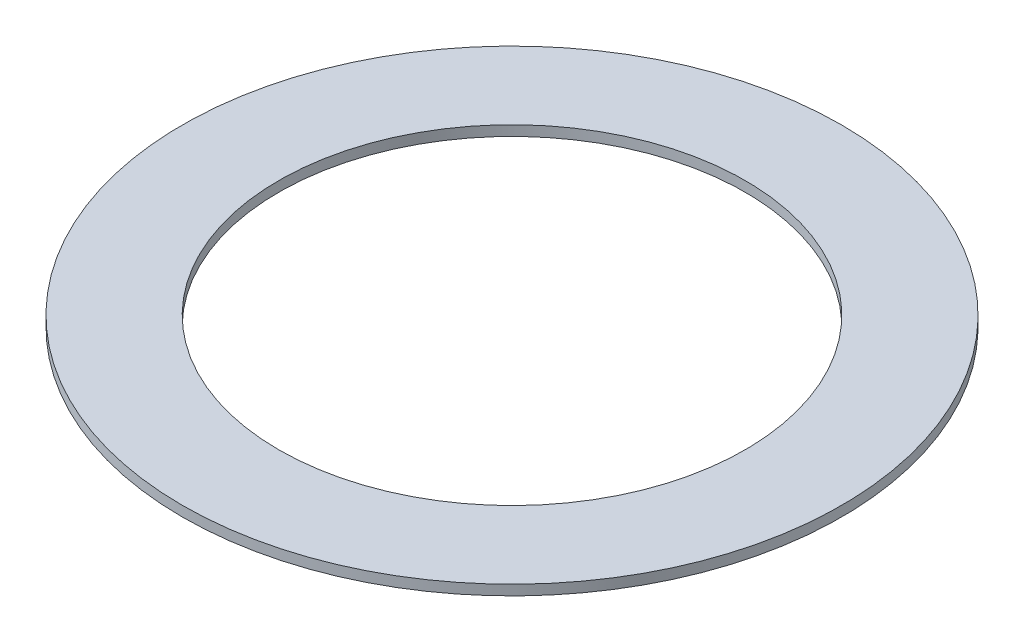
ISO-10303-21;
HEADER;
FILE_DESCRIPTION(('STEP AP214'),'2;1');
FILE_NAME('part.step','',(''),(''),'','','');
FILE_SCHEMA(('AUTOMOTIVE_DESIGN { 1 0 10303 214 1 1 1 1 }'));
ENDSEC;
DATA;
#1=APPLICATION_CONTEXT('core data for automotive mechanical design processes');
#2=APPLICATION_PROTOCOL_DEFINITION('international standard','automotive_design',2000,#1);
#3=PRODUCT_CONTEXT('',#1,'mechanical');
#4=PRODUCT('Part','Part','',(#3));
#5=PRODUCT_RELATED_PRODUCT_CATEGORY('part','',(#4));
#6=PRODUCT_DEFINITION_FORMATION('','',#4);
#7=PRODUCT_DEFINITION_CONTEXT('part definition',#1,'design');
#8=PRODUCT_DEFINITION('design','',#6,#7);
#9=PRODUCT_DEFINITION_SHAPE('','',#8);
#10=(LENGTH_UNIT() NAMED_UNIT(*) SI_UNIT(.MILLI.,.METRE.));
#11=(NAMED_UNIT(*) PLANE_ANGLE_UNIT() SI_UNIT($,.RADIAN.));
#12=(NAMED_UNIT(*) SI_UNIT($,.STERADIAN.) SOLID_ANGLE_UNIT());
#13=UNCERTAINTY_MEASURE_WITH_UNIT(LENGTH_MEASURE(1.E-05),#10,'distance_accuracy_value','');
#14=(GEOMETRIC_REPRESENTATION_CONTEXT(3) GLOBAL_UNCERTAINTY_ASSIGNED_CONTEXT((#13)) GLOBAL_UNIT_ASSIGNED_CONTEXT((#10,
#11,#12)) REPRESENTATION_CONTEXT('',''));
#15=CARTESIAN_POINT('',(0.,0.,0.));
#16=DIRECTION('',(0.,0.,1.));
#17=DIRECTION('',(1.,0.,0.));
#18=AXIS2_PLACEMENT_3D('',#15,#16,#17);
#19=CARTESIAN_POINT('',(0.,1.,0.));
#20=DIRECTION('',(0.,1.,0.));
#21=DIRECTION('',(0.,0.,1.));
#22=AXIS2_PLACEMENT_3D('',#19,#20,#21);
#23=PLANE('',#22);
#24=CARTESIAN_POINT('',(0.,1.,0.));
#25=DIRECTION('',(0.,1.,0.));
#26=DIRECTION('',(0.,0.,1.));
#27=AXIS2_PLACEMENT_3D('',#24,#25,#26);
#28=CIRCLE('',#27,32.5);
#29=CARTESIAN_POINT('',(0.,1.,32.5));
#30=VERTEX_POINT('',#29);
#31=EDGE_CURVE('E10',#30,#30,#28,.T.);
#32=ORIENTED_EDGE('',*,*,#31,.T.);
#33=EDGE_LOOP('',(#32));
#34=FACE_BOUND('',#33,.T.);
#35=CARTESIAN_POINT('',(0.,1.,0.));
#36=DIRECTION('',(0.,1.,0.));
#37=DIRECTION('',(0.,0.,1.));
#38=AXIS2_PLACEMENT_3D('',#35,#36,#37);
#39=CIRCLE('',#38,23.);
#40=CARTESIAN_POINT('',(0.,1.,23.));
#41=VERTEX_POINT('',#40);
#42=EDGE_CURVE('E41',#41,#41,#39,.T.);
#43=ORIENTED_EDGE('',*,*,#42,.F.);
#44=EDGE_LOOP('',(#43));
#45=FACE_BOUND('',#44,.T.);
#46=ADVANCED_FACE('F30',(#34,#45),#23,.T.);
#47=CARTESIAN_POINT('',(0.,0.,0.));
#48=DIRECTION('',(0.,1.,0.));
#49=DIRECTION('',(0.,0.,1.));
#50=AXIS2_PLACEMENT_3D('',#47,#48,#49);
#51=PLANE('',#50);
#52=CARTESIAN_POINT('',(0.,0.,0.));
#53=DIRECTION('',(0.,1.,0.));
#54=DIRECTION('',(0.,0.,1.));
#55=AXIS2_PLACEMENT_3D('',#52,#53,#54);
#56=CIRCLE('',#55,32.5);
#57=CARTESIAN_POINT('',(0.,0.,32.5));
#58=VERTEX_POINT('',#57);
#59=EDGE_CURVE('E34',#58,#58,#56,.T.);
#60=ORIENTED_EDGE('',*,*,#59,.F.);
#61=EDGE_LOOP('',(#60));
#62=FACE_BOUND('',#61,.T.);
#63=CARTESIAN_POINT('',(0.,0.,0.));
#64=DIRECTION('',(0.,1.,0.));
#65=DIRECTION('',(0.,0.,1.));
#66=AXIS2_PLACEMENT_3D('',#63,#64,#65);
#67=CIRCLE('',#66,23.);
#68=CARTESIAN_POINT('',(0.,0.,23.));
#69=VERTEX_POINT('',#68);
#70=EDGE_CURVE('E43',#69,#69,#67,.T.);
#71=ORIENTED_EDGE('',*,*,#70,.T.);
#72=EDGE_LOOP('',(#71));
#73=FACE_BOUND('',#72,.T.);
#74=ADVANCED_FACE('F53',(#62,#73),#51,.F.);
#75=CARTESIAN_POINT('',(0.,1.,0.));
#76=DIRECTION('',(0.,-1.,0.));
#77=DIRECTION('',(0.,0.,-1.));
#78=AXIS2_PLACEMENT_3D('',#75,#76,#77);
#79=CYLINDRICAL_SURFACE('',#78,32.5);
#80=ORIENTED_EDGE('',*,*,#31,.F.);
#81=EDGE_LOOP('',(#80));
#82=FACE_BOUND('',#81,.T.);
#83=ORIENTED_EDGE('',*,*,#59,.T.);
#84=EDGE_LOOP('',(#83));
#85=FACE_BOUND('',#84,.T.);
#86=ADVANCED_FACE('F32',(#82,#85),#79,.T.);
#87=CARTESIAN_POINT('',(0.,1.,0.));
#88=DIRECTION('',(0.,-1.,0.));
#89=DIRECTION('',(0.,0.,-1.));
#90=AXIS2_PLACEMENT_3D('',#87,#88,#89);
#91=CYLINDRICAL_SURFACE('',#90,23.);
#92=ORIENTED_EDGE('',*,*,#42,.T.);
#93=EDGE_LOOP('',(#92));
#94=FACE_BOUND('',#93,.T.);
#95=ORIENTED_EDGE('',*,*,#70,.F.);
#96=EDGE_LOOP('',(#95));
#97=FACE_BOUND('',#96,.T.);
#98=ADVANCED_FACE('F49',(#94,#97),#91,.F.);
#99=CLOSED_SHELL('',(#46,#74,#86,#98));
#100=MANIFOLD_SOLID_BREP('B2',#99);
#101=ADVANCED_BREP_SHAPE_REPRESENTATION('',(#18,#100),#14);
#102=SHAPE_DEFINITION_REPRESENTATION(#9,#101);
ENDSEC;
END-ISO-10303-21;
